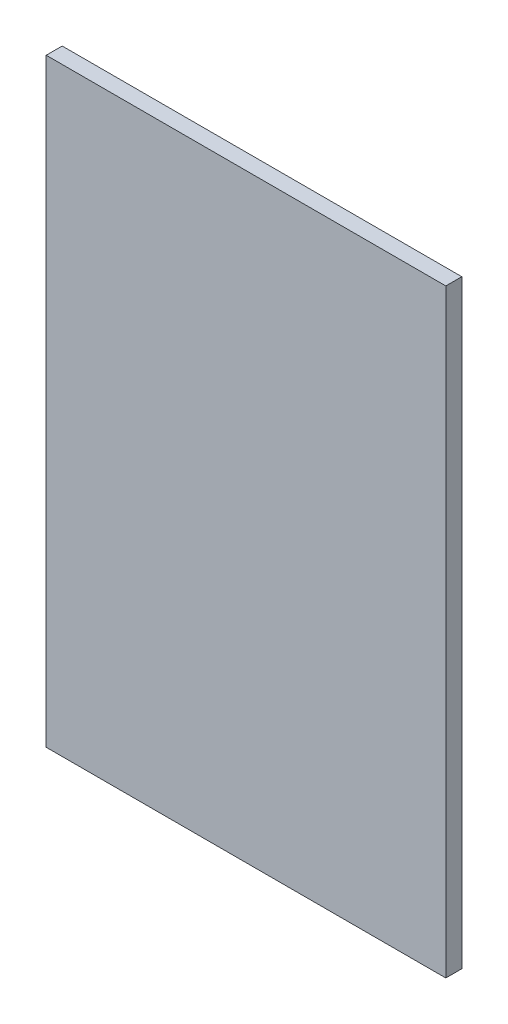
ISO-10303-21;
HEADER;
FILE_DESCRIPTION(('STEP AP214'),'2;1');
FILE_NAME('part.step','',(''),(''),'','','');
FILE_SCHEMA(('AUTOMOTIVE_DESIGN { 1 0 10303 214 1 1 1 1 }'));
ENDSEC;
DATA;
#1=APPLICATION_CONTEXT('core data for automotive mechanical design processes');
#2=APPLICATION_PROTOCOL_DEFINITION('international standard','automotive_design',2000,#1);
#3=PRODUCT_CONTEXT('',#1,'mechanical');
#4=PRODUCT('Part','Part','',(#3));
#5=PRODUCT_RELATED_PRODUCT_CATEGORY('part','',(#4));
#6=PRODUCT_DEFINITION_FORMATION('','',#4);
#7=PRODUCT_DEFINITION_CONTEXT('part definition',#1,'design');
#8=PRODUCT_DEFINITION('design','',#6,#7);
#9=PRODUCT_DEFINITION_SHAPE('','',#8);
#10=(LENGTH_UNIT() NAMED_UNIT(*) SI_UNIT(.MILLI.,.METRE.));
#11=(NAMED_UNIT(*) PLANE_ANGLE_UNIT() SI_UNIT($,.RADIAN.));
#12=(NAMED_UNIT(*) SI_UNIT($,.STERADIAN.) SOLID_ANGLE_UNIT());
#13=UNCERTAINTY_MEASURE_WITH_UNIT(LENGTH_MEASURE(1.E-05),#10,'distance_accuracy_value','');
#14=(GEOMETRIC_REPRESENTATION_CONTEXT(3) GLOBAL_UNCERTAINTY_ASSIGNED_CONTEXT((#13)) GLOBAL_UNIT_ASSIGNED_CONTEXT((#10,
#11,#12)) REPRESENTATION_CONTEXT('',''));
#15=CARTESIAN_POINT('',(0.,0.,0.));
#16=DIRECTION('',(0.,0.,1.));
#17=DIRECTION('',(1.,0.,0.));
#18=AXIS2_PLACEMENT_3D('',#15,#16,#17);
#19=CARTESIAN_POINT('',(0.,0.,4.));
#20=DIRECTION('',(1.,0.,0.));
#21=DIRECTION('',(0.,0.,-1.));
#22=AXIS2_PLACEMENT_3D('',#19,#20,#21);
#23=PLANE('',#22);
#24=DIRECTION('',(0.,-1.,0.));
#25=VECTOR('',#24,1.);
#26=CARTESIAN_POINT('',(0.,0.,0.));
#27=LINE('',#26,#25);
#28=CARTESIAN_POINT('',(0.,150.,0.));
#29=VERTEX_POINT('',#28);
#30=CARTESIAN_POINT('',(0.,0.,0.));
#31=VERTEX_POINT('',#30);
#32=EDGE_CURVE('E99',#29,#31,#27,.T.);
#33=ORIENTED_EDGE('',*,*,#32,.T.);
#34=DIRECTION('',(0.,0.,-1.));
#35=VECTOR('',#34,1.);
#36=CARTESIAN_POINT('',(0.,0.,4.));
#37=LINE('',#36,#35);
#38=CARTESIAN_POINT('',(0.,0.,4.));
#39=VERTEX_POINT('',#38);
#40=EDGE_CURVE('E11',#39,#31,#37,.T.);
#41=ORIENTED_EDGE('',*,*,#40,.F.);
#42=DIRECTION('',(0.,-1.,0.));
#43=VECTOR('',#42,1.);
#44=CARTESIAN_POINT('',(0.,0.,4.));
#45=LINE('',#44,#43);
#46=CARTESIAN_POINT('',(0.,150.,4.));
#47=VERTEX_POINT('',#46);
#48=EDGE_CURVE('E87',#47,#39,#45,.T.);
#49=ORIENTED_EDGE('',*,*,#48,.F.);
#50=DIRECTION('',(0.,0.,-1.));
#51=VECTOR('',#50,1.);
#52=CARTESIAN_POINT('',(0.,150.,4.));
#53=LINE('',#52,#51);
#54=EDGE_CURVE('E95',#47,#29,#53,.T.);
#55=ORIENTED_EDGE('',*,*,#54,.T.);
#56=EDGE_LOOP('',(#33,#41,#49,#55));
#57=FACE_BOUND('',#56,.T.);
#58=ADVANCED_FACE('F36',(#57),#23,.F.);
#59=CARTESIAN_POINT('',(0.,0.,4.));
#60=DIRECTION('',(0.,1.,0.));
#61=DIRECTION('',(0.,0.,1.));
#62=AXIS2_PLACEMENT_3D('',#59,#60,#61);
#63=PLANE('',#62);
#64=DIRECTION('',(1.,0.,0.));
#65=VECTOR('',#64,1.);
#66=CARTESIAN_POINT('',(0.,0.,0.));
#67=LINE('',#66,#65);
#68=CARTESIAN_POINT('',(100.,0.,0.));
#69=VERTEX_POINT('',#68);
#70=EDGE_CURVE('E91',#31,#69,#67,.T.);
#71=ORIENTED_EDGE('',*,*,#70,.T.);
#72=DIRECTION('',(0.,0.,-1.));
#73=VECTOR('',#72,1.);
#74=CARTESIAN_POINT('',(100.,0.,4.));
#75=LINE('',#74,#73);
#76=CARTESIAN_POINT('',(100.,0.,4.));
#77=VERTEX_POINT('',#76);
#78=EDGE_CURVE('E44',#77,#69,#75,.T.);
#79=ORIENTED_EDGE('',*,*,#78,.F.);
#80=DIRECTION('',(1.,0.,0.));
#81=VECTOR('',#80,1.);
#82=CARTESIAN_POINT('',(0.,0.,4.));
#83=LINE('',#82,#81);
#84=EDGE_CURVE('E82',#39,#77,#83,.T.);
#85=ORIENTED_EDGE('',*,*,#84,.F.);
#86=ORIENTED_EDGE('',*,*,#40,.T.);
#87=EDGE_LOOP('',(#71,#79,#85,#86));
#88=FACE_BOUND('',#87,.T.);
#89=ADVANCED_FACE('F90',(#88),#63,.F.);
#90=CARTESIAN_POINT('',(100.,0.,4.));
#91=DIRECTION('',(-1.,0.,0.));
#92=DIRECTION('',(0.,0.,1.));
#93=AXIS2_PLACEMENT_3D('',#90,#91,#92);
#94=PLANE('',#93);
#95=DIRECTION('',(0.,1.,0.));
#96=VECTOR('',#95,1.);
#97=CARTESIAN_POINT('',(100.,0.,0.));
#98=LINE('',#97,#96);
#99=CARTESIAN_POINT('',(100.,150.,0.));
#100=VERTEX_POINT('',#99);
#101=EDGE_CURVE('E69',#69,#100,#98,.T.);
#102=ORIENTED_EDGE('',*,*,#101,.T.);
#103=DIRECTION('',(0.,0.,-1.));
#104=VECTOR('',#103,1.);
#105=CARTESIAN_POINT('',(100.,150.,4.));
#106=LINE('',#105,#104);
#107=CARTESIAN_POINT('',(100.,150.,4.));
#108=VERTEX_POINT('',#107);
#109=EDGE_CURVE('E92',#108,#100,#106,.T.);
#110=ORIENTED_EDGE('',*,*,#109,.F.);
#111=DIRECTION('',(0.,1.,0.));
#112=VECTOR('',#111,1.);
#113=CARTESIAN_POINT('',(100.,0.,4.));
#114=LINE('',#113,#112);
#115=EDGE_CURVE('E85',#77,#108,#114,.T.);
#116=ORIENTED_EDGE('',*,*,#115,.F.);
#117=ORIENTED_EDGE('',*,*,#78,.T.);
#118=EDGE_LOOP('',(#102,#110,#116,#117));
#119=FACE_BOUND('',#118,.T.);
#120=ADVANCED_FACE('F93',(#119),#94,.F.);
#121=CARTESIAN_POINT('',(0.,150.,4.));
#122=DIRECTION('',(0.,-1.,0.));
#123=DIRECTION('',(0.,0.,-1.));
#124=AXIS2_PLACEMENT_3D('',#121,#122,#123);
#125=PLANE('',#124);
#126=DIRECTION('',(-1.,0.,0.));
#127=VECTOR('',#126,1.);
#128=CARTESIAN_POINT('',(0.,150.,0.));
#129=LINE('',#128,#127);
#130=EDGE_CURVE('E75',#100,#29,#129,.T.);
#131=ORIENTED_EDGE('',*,*,#130,.T.);
#132=ORIENTED_EDGE('',*,*,#54,.F.);
#133=DIRECTION('',(-1.,0.,0.));
#134=VECTOR('',#133,1.);
#135=CARTESIAN_POINT('',(0.,150.,4.));
#136=LINE('',#135,#134);
#137=EDGE_CURVE('E52',#108,#47,#136,.T.);
#138=ORIENTED_EDGE('',*,*,#137,.F.);
#139=ORIENTED_EDGE('',*,*,#109,.T.);
#140=EDGE_LOOP('',(#131,#132,#138,#139));
#141=FACE_BOUND('',#140,.T.);
#142=ADVANCED_FACE('F106',(#141),#125,.F.);
#143=CARTESIAN_POINT('',(0.,0.,4.));
#144=DIRECTION('',(0.,0.,-1.));
#145=DIRECTION('',(-1.,0.,0.));
#146=AXIS2_PLACEMENT_3D('',#143,#144,#145);
#147=PLANE('',#146);
#148=ORIENTED_EDGE('',*,*,#48,.T.);
#149=ORIENTED_EDGE('',*,*,#84,.T.);
#150=ORIENTED_EDGE('',*,*,#115,.T.);
#151=ORIENTED_EDGE('',*,*,#137,.T.);
#152=EDGE_LOOP('',(#148,#149,#150,#151));
#153=FACE_BOUND('',#152,.T.);
#154=ADVANCED_FACE('F83',(#153),#147,.F.);
#155=CARTESIAN_POINT('',(0.,0.,0.));
#156=DIRECTION('',(0.,0.,-1.));
#157=DIRECTION('',(-1.,0.,0.));
#158=AXIS2_PLACEMENT_3D('',#155,#156,#157);
#159=PLANE('',#158);
#160=ORIENTED_EDGE('',*,*,#32,.F.);
#161=ORIENTED_EDGE('',*,*,#130,.F.);
#162=ORIENTED_EDGE('',*,*,#101,.F.);
#163=ORIENTED_EDGE('',*,*,#70,.F.);
#164=EDGE_LOOP('',(#160,#161,#162,#163));
#165=FACE_BOUND('',#164,.T.);
#166=ADVANCED_FACE('F109',(#165),#159,.T.);
#167=CLOSED_SHELL('',(#58,#89,#120,#142,#154,#166));
#168=MANIFOLD_SOLID_BREP('B2',#167);
#169=ADVANCED_BREP_SHAPE_REPRESENTATION('',(#18,#168),#14);
#170=SHAPE_DEFINITION_REPRESENTATION(#9,#169);
ENDSEC;
END-ISO-10303-21;
